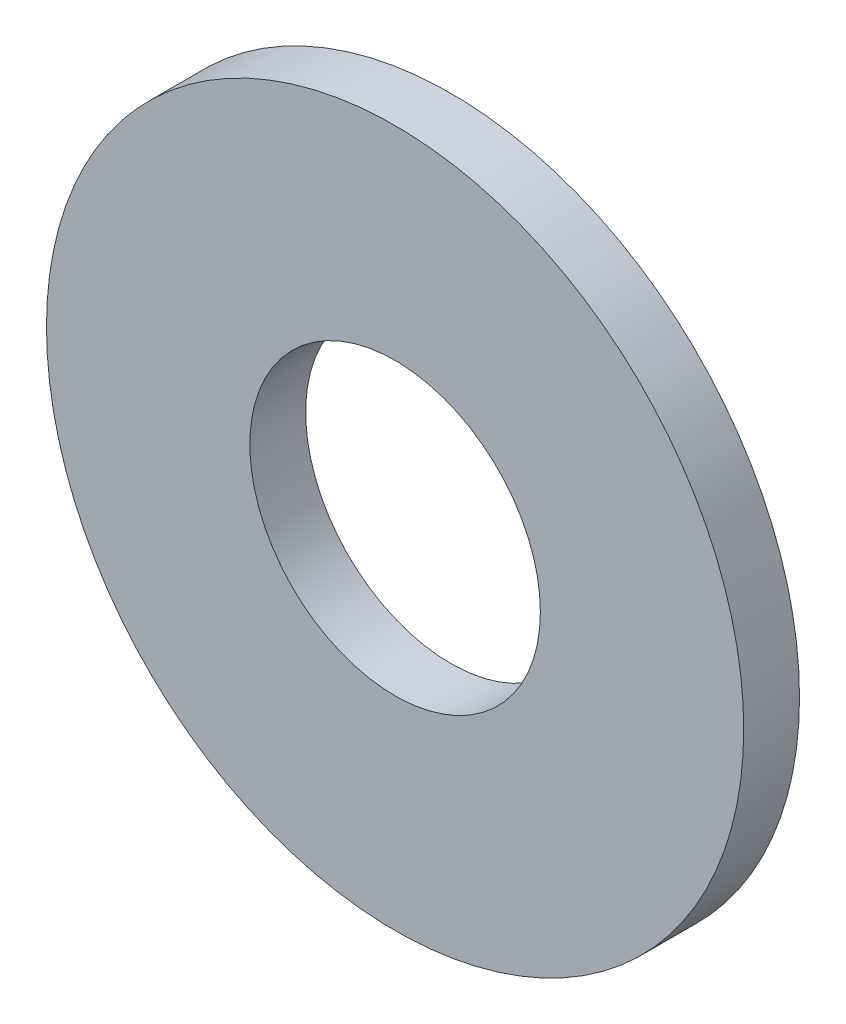
ISO-10303-21;
HEADER;
FILE_DESCRIPTION(('STEP AP214'),'2;1');
FILE_NAME('part.step','',(''),(''),'','','');
FILE_SCHEMA(('AUTOMOTIVE_DESIGN { 1 0 10303 214 1 1 1 1 }'));
ENDSEC;
DATA;
#1=APPLICATION_CONTEXT('core data for automotive mechanical design processes');
#2=APPLICATION_PROTOCOL_DEFINITION('international standard','automotive_design',2000,#1);
#3=PRODUCT_CONTEXT('',#1,'mechanical');
#4=PRODUCT('Part','Part','',(#3));
#5=PRODUCT_RELATED_PRODUCT_CATEGORY('part','',(#4));
#6=PRODUCT_DEFINITION_FORMATION('','',#4);
#7=PRODUCT_DEFINITION_CONTEXT('part definition',#1,'design');
#8=PRODUCT_DEFINITION('design','',#6,#7);
#9=PRODUCT_DEFINITION_SHAPE('','',#8);
#10=(LENGTH_UNIT() NAMED_UNIT(*) SI_UNIT(.MILLI.,.METRE.));
#11=(NAMED_UNIT(*) PLANE_ANGLE_UNIT() SI_UNIT($,.RADIAN.));
#12=(NAMED_UNIT(*) SI_UNIT($,.STERADIAN.) SOLID_ANGLE_UNIT());
#13=UNCERTAINTY_MEASURE_WITH_UNIT(LENGTH_MEASURE(1.E-05),#10,'distance_accuracy_value','');
#14=(GEOMETRIC_REPRESENTATION_CONTEXT(3) GLOBAL_UNCERTAINTY_ASSIGNED_CONTEXT((#13)) GLOBAL_UNIT_ASSIGNED_CONTEXT((#10,
#11,#12)) REPRESENTATION_CONTEXT('',''));
#15=CARTESIAN_POINT('',(0.,0.,0.));
#16=DIRECTION('',(0.,0.,1.));
#17=DIRECTION('',(1.,0.,0.));
#18=AXIS2_PLACEMENT_3D('',#15,#16,#17);
#19=CARTESIAN_POINT('',(0.,0.,-0.762));
#20=DIRECTION('',(0.,0.,1.));
#21=DIRECTION('',(1.,0.,0.));
#22=AXIS2_PLACEMENT_3D('',#19,#20,#21);
#23=CYLINDRICAL_SURFACE('',#22,4.7625);
#24=CARTESIAN_POINT('',(0.,0.,-0.762));
#25=DIRECTION('',(0.,0.,1.));
#26=DIRECTION('',(1.,0.,0.));
#27=AXIS2_PLACEMENT_3D('',#24,#25,#26);
#28=CIRCLE('',#27,4.7625);
#29=CARTESIAN_POINT('',(4.7625,0.,-0.762));
#30=VERTEX_POINT('',#29);
#31=EDGE_CURVE('E10',#30,#30,#28,.T.);
#32=ORIENTED_EDGE('',*,*,#31,.T.);
#33=EDGE_LOOP('',(#32));
#34=FACE_BOUND('',#33,.T.);
#35=CARTESIAN_POINT('',(0.,0.,0.));
#36=DIRECTION('',(0.,0.,1.));
#37=DIRECTION('',(1.,0.,0.));
#38=AXIS2_PLACEMENT_3D('',#35,#36,#37);
#39=CIRCLE('',#38,4.7625);
#40=CARTESIAN_POINT('',(4.7625,0.,0.));
#41=VERTEX_POINT('',#40);
#42=EDGE_CURVE('E32',#41,#41,#39,.T.);
#43=ORIENTED_EDGE('',*,*,#42,.F.);
#44=EDGE_LOOP('',(#43));
#45=FACE_BOUND('',#44,.T.);
#46=ADVANCED_FACE('F29',(#34,#45),#23,.T.);
#47=CARTESIAN_POINT('',(0.,0.,-0.762));
#48=DIRECTION('',(0.,0.,1.));
#49=DIRECTION('',(1.,0.,0.));
#50=AXIS2_PLACEMENT_3D('',#47,#48,#49);
#51=PLANE('',#50);
#52=CARTESIAN_POINT('',(0.,0.,-0.762));
#53=DIRECTION('',(0.,0.,1.));
#54=DIRECTION('',(1.,0.,0.));
#55=AXIS2_PLACEMENT_3D('',#52,#53,#54);
#56=CIRCLE('',#55,1.984375);
#57=CARTESIAN_POINT('',(1.984375,0.,-0.762));
#58=VERTEX_POINT('',#57);
#59=EDGE_CURVE('E39',#58,#58,#56,.T.);
#60=ORIENTED_EDGE('',*,*,#59,.T.);
#61=EDGE_LOOP('',(#60));
#62=FACE_BOUND('',#61,.T.);
#63=ORIENTED_EDGE('',*,*,#31,.F.);
#64=EDGE_LOOP('',(#63));
#65=FACE_BOUND('',#64,.T.);
#66=ADVANCED_FACE('F47',(#62,#65),#51,.F.);
#67=CARTESIAN_POINT('',(0.,0.,0.));
#68=DIRECTION('',(0.,0.,1.));
#69=DIRECTION('',(1.,0.,0.));
#70=AXIS2_PLACEMENT_3D('',#67,#68,#69);
#71=PLANE('',#70);
#72=CARTESIAN_POINT('',(0.,0.,0.));
#73=DIRECTION('',(0.,0.,1.));
#74=DIRECTION('',(1.,0.,0.));
#75=AXIS2_PLACEMENT_3D('',#72,#73,#74);
#76=CIRCLE('',#75,1.984375);
#77=CARTESIAN_POINT('',(1.984375,0.,0.));
#78=VERTEX_POINT('',#77);
#79=EDGE_CURVE('E41',#78,#78,#76,.T.);
#80=ORIENTED_EDGE('',*,*,#79,.F.);
#81=EDGE_LOOP('',(#80));
#82=FACE_BOUND('',#81,.T.);
#83=ORIENTED_EDGE('',*,*,#42,.T.);
#84=EDGE_LOOP('',(#83));
#85=FACE_BOUND('',#84,.T.);
#86=ADVANCED_FACE('F53',(#82,#85),#71,.T.);
#87=CARTESIAN_POINT('',(0.,0.,-0.762));
#88=DIRECTION('',(0.,0.,1.));
#89=DIRECTION('',(1.,0.,0.));
#90=AXIS2_PLACEMENT_3D('',#87,#88,#89);
#91=CYLINDRICAL_SURFACE('',#90,1.984375);
#92=ORIENTED_EDGE('',*,*,#59,.F.);
#93=EDGE_LOOP('',(#92));
#94=FACE_BOUND('',#93,.T.);
#95=ORIENTED_EDGE('',*,*,#79,.T.);
#96=EDGE_LOOP('',(#95));
#97=FACE_BOUND('',#96,.T.);
#98=ADVANCED_FACE('F50',(#94,#97),#91,.F.);
#99=CLOSED_SHELL('',(#46,#66,#86,#98));
#100=MANIFOLD_SOLID_BREP('B2',#99);
#101=ADVANCED_BREP_SHAPE_REPRESENTATION('',(#18,#100),#14);
#102=SHAPE_DEFINITION_REPRESENTATION(#9,#101);
ENDSEC;
END-ISO-10303-21;
